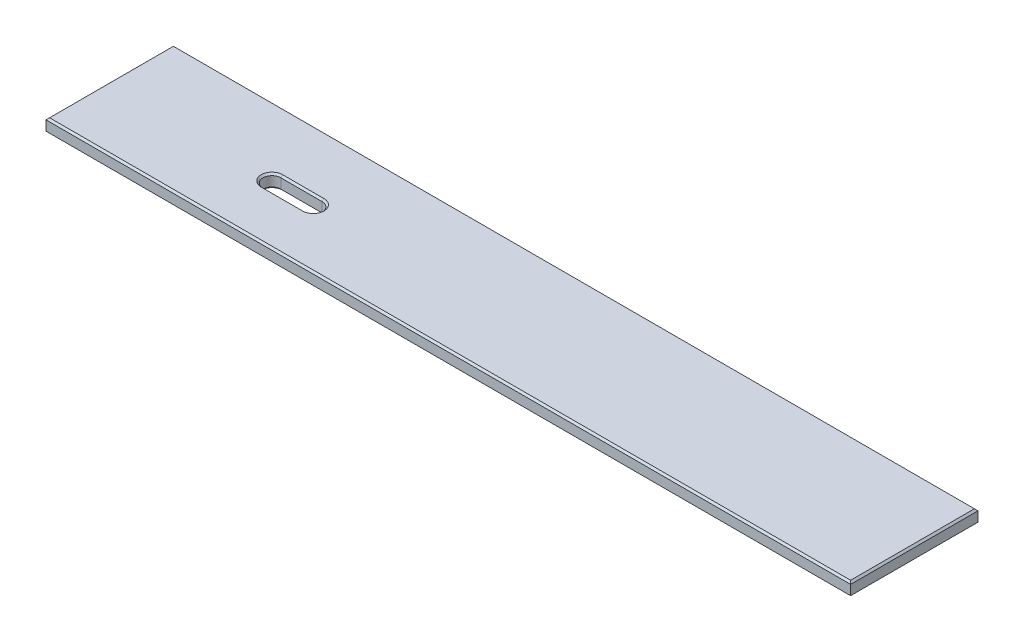
ISO-10303-21;
HEADER;
FILE_DESCRIPTION(('STEP AP214'),'2;1');
FILE_NAME('part.step','',(''),(''),'','','');
FILE_SCHEMA(('AUTOMOTIVE_DESIGN { 1 0 10303 214 1 1 1 1 }'));
ENDSEC;
DATA;
#1=APPLICATION_CONTEXT('core data for automotive mechanical design processes');
#2=APPLICATION_PROTOCOL_DEFINITION('international standard','automotive_design',2000,#1);
#3=PRODUCT_CONTEXT('',#1,'mechanical');
#4=PRODUCT('Part','Part','',(#3));
#5=PRODUCT_RELATED_PRODUCT_CATEGORY('part','',(#4));
#6=PRODUCT_DEFINITION_FORMATION('','',#4);
#7=PRODUCT_DEFINITION_CONTEXT('part definition',#1,'design');
#8=PRODUCT_DEFINITION('design','',#6,#7);
#9=PRODUCT_DEFINITION_SHAPE('','',#8);
#10=(LENGTH_UNIT() NAMED_UNIT(*) SI_UNIT(.MILLI.,.METRE.));
#11=(NAMED_UNIT(*) PLANE_ANGLE_UNIT() SI_UNIT($,.RADIAN.));
#12=(NAMED_UNIT(*) SI_UNIT($,.STERADIAN.) SOLID_ANGLE_UNIT());
#13=UNCERTAINTY_MEASURE_WITH_UNIT(LENGTH_MEASURE(1.E-05),#10,'distance_accuracy_value','');
#14=(GEOMETRIC_REPRESENTATION_CONTEXT(3) GLOBAL_UNCERTAINTY_ASSIGNED_CONTEXT((#13)) GLOBAL_UNIT_ASSIGNED_CONTEXT((#10,
#11,#12)) REPRESENTATION_CONTEXT('',''));
#15=CARTESIAN_POINT('',(0.,0.,0.));
#16=DIRECTION('',(0.,0.,1.));
#17=DIRECTION('',(1.,0.,0.));
#18=AXIS2_PLACEMENT_3D('',#15,#16,#17);
#19=CARTESIAN_POINT('',(0.,19.05,0.));
#20=DIRECTION('',(0.,-1.,0.));
#21=DIRECTION('',(0.,0.,-1.));
#22=AXIS2_PLACEMENT_3D('',#19,#20,#21);
#23=PLANE('',#22);
#24=CARTESIAN_POINT('',(238.125,19.05,-82.7913));
#25=DIRECTION('',(0.,-1.,0.));
#26=DIRECTION('',(0.,0.,-1.));
#27=AXIS2_PLACEMENT_3D('',#24,#25,#26);
#28=CIRCLE('',#27,15.2400000000006);
#29=CARTESIAN_POINT('',(238.125,19.05,-67.5512999999994));
#30=VERTEX_POINT('',#29);
#31=CARTESIAN_POINT('',(238.125,19.05,-98.0313000000006));
#32=VERTEX_POINT('',#31);
#33=EDGE_CURVE('E217',#30,#32,#28,.T.);
#34=ORIENTED_EDGE('',*,*,#33,.T.);
#35=DIRECTION('',(1.,0.,0.));
#36=VECTOR('',#35,1.);
#37=CARTESIAN_POINT('',(296.8752,19.05,-98.0313000000006));
#38=LINE('',#37,#36);
#39=CARTESIAN_POINT('',(296.8752,19.05,-98.0313000000006));
#40=VERTEX_POINT('',#39);
#41=EDGE_CURVE('E219',#32,#40,#38,.T.);
#42=ORIENTED_EDGE('',*,*,#41,.T.);
#43=CARTESIAN_POINT('',(296.8752,19.05,-82.7913));
#44=DIRECTION('',(0.,-1.,0.));
#45=DIRECTION('',(0.,0.,-1.));
#46=AXIS2_PLACEMENT_3D('',#43,#44,#45);
#47=CIRCLE('',#46,15.2400000000006);
#48=CARTESIAN_POINT('',(296.8752,19.05,-67.5512999999994));
#49=VERTEX_POINT('',#48);
#50=EDGE_CURVE('E188',#40,#49,#47,.T.);
#51=ORIENTED_EDGE('',*,*,#50,.T.);
#52=DIRECTION('',(-1.,0.,0.));
#53=VECTOR('',#52,1.);
#54=CARTESIAN_POINT('',(238.125,19.05,-67.5512999999994));
#55=LINE('',#54,#53);
#56=EDGE_CURVE('E215',#49,#30,#55,.T.);
#57=ORIENTED_EDGE('',*,*,#56,.T.);
#58=EDGE_LOOP('',(#34,#42,#51,#57));
#59=FACE_BOUND('',#58,.T.);
#60=DIRECTION('',(0.,0.,-1.));
#61=VECTOR('',#60,1.);
#62=CARTESIAN_POINT('',(1140.46,19.05,0.));
#63=LINE('',#62,#61);
#64=CARTESIAN_POINT('',(1140.46,19.05,-2.5400000000001));
#65=VERTEX_POINT('',#64);
#66=CARTESIAN_POINT('',(1140.46,19.05,-178.435));
#67=VERTEX_POINT('',#66);
#68=EDGE_CURVE('E209',#65,#67,#63,.T.);
#69=ORIENTED_EDGE('',*,*,#68,.T.);
#70=DIRECTION('',(-1.,0.,0.));
#71=VECTOR('',#70,1.);
#72=CARTESIAN_POINT('',(0.,19.05,-178.435));
#73=LINE('',#72,#71);
#74=CARTESIAN_POINT('',(2.5400000000001,19.05,-178.435));
#75=VERTEX_POINT('',#74);
#76=EDGE_CURVE('E211',#67,#75,#73,.T.);
#77=ORIENTED_EDGE('',*,*,#76,.T.);
#78=DIRECTION('',(0.,0.,1.));
#79=VECTOR('',#78,1.);
#80=CARTESIAN_POINT('',(2.5400000000001,19.05,0.));
#81=LINE('',#80,#79);
#82=CARTESIAN_POINT('',(2.5400000000001,19.05,-2.5400000000001));
#83=VERTEX_POINT('',#82);
#84=EDGE_CURVE('E198',#75,#83,#81,.T.);
#85=ORIENTED_EDGE('',*,*,#84,.T.);
#86=DIRECTION('',(1.,0.,0.));
#87=VECTOR('',#86,1.);
#88=CARTESIAN_POINT('',(0.,19.05,-2.5400000000001));
#89=LINE('',#88,#87);
#90=EDGE_CURVE('E201',#83,#65,#89,.T.);
#91=ORIENTED_EDGE('',*,*,#90,.T.);
#92=EDGE_LOOP('',(#69,#77,#85,#91));
#93=FACE_BOUND('',#92,.T.);
#94=ADVANCED_FACE('F41',(#59,#93),#23,.F.);
#95=CARTESIAN_POINT('',(0.,0.,0.));
#96=DIRECTION('',(0.,-1.,0.));
#97=DIRECTION('',(0.,0.,-1.));
#98=AXIS2_PLACEMENT_3D('',#95,#96,#97);
#99=PLANE('',#98);
#100=DIRECTION('',(-1.,0.,0.));
#101=VECTOR('',#100,1.);
#102=CARTESIAN_POINT('',(0.,0.,-98.0313));
#103=LINE('',#102,#101);
#104=CARTESIAN_POINT('',(296.8752,0.,-98.0313000000001));
#105=VERTEX_POINT('',#104);
#106=CARTESIAN_POINT('',(238.125,0.,-98.0313000000001));
#107=VERTEX_POINT('',#106);
#108=EDGE_CURVE('E261',#105,#107,#103,.T.);
#109=ORIENTED_EDGE('',*,*,#108,.T.);
#110=CARTESIAN_POINT('',(238.125,0.,-82.7913));
#111=DIRECTION('',(0.,-1.,0.));
#112=DIRECTION('',(0.,0.,-1.));
#113=AXIS2_PLACEMENT_3D('',#110,#111,#112);
#114=CIRCLE('',#113,15.2400000000001);
#115=CARTESIAN_POINT('',(238.125,0.,-67.5512999999999));
#116=VERTEX_POINT('',#115);
#117=EDGE_CURVE('E263',#107,#116,#114,.F.);
#118=ORIENTED_EDGE('',*,*,#117,.T.);
#119=DIRECTION('',(1.,0.,0.));
#120=VECTOR('',#119,1.);
#121=CARTESIAN_POINT('',(0.,0.,-67.5512999999998));
#122=LINE('',#121,#120);
#123=CARTESIAN_POINT('',(296.8752,0.,-67.5512999999999));
#124=VERTEX_POINT('',#123);
#125=EDGE_CURVE('E257',#116,#124,#122,.T.);
#126=ORIENTED_EDGE('',*,*,#125,.T.);
#127=CARTESIAN_POINT('',(296.8752,0.,-82.7913));
#128=DIRECTION('',(0.,-1.,0.));
#129=DIRECTION('',(0.,0.,-1.));
#130=AXIS2_PLACEMENT_3D('',#127,#128,#129);
#131=CIRCLE('',#130,15.2400000000001);
#132=EDGE_CURVE('E259',#124,#105,#131,.F.);
#133=ORIENTED_EDGE('',*,*,#132,.T.);
#134=EDGE_LOOP('',(#109,#118,#126,#133));
#135=FACE_BOUND('',#134,.T.);
#136=DIRECTION('',(0.,0.,1.));
#137=VECTOR('',#136,1.);
#138=CARTESIAN_POINT('',(1140.46,0.,0.));
#139=LINE('',#138,#137);
#140=CARTESIAN_POINT('',(1140.46,0.,-178.435));
#141=VERTEX_POINT('',#140);
#142=CARTESIAN_POINT('',(1140.46,0.,-2.53999999999999));
#143=VERTEX_POINT('',#142);
#144=EDGE_CURVE('E252',#141,#143,#139,.T.);
#145=ORIENTED_EDGE('',*,*,#144,.T.);
#146=DIRECTION('',(-1.,0.,0.));
#147=VECTOR('',#146,1.);
#148=CARTESIAN_POINT('',(0.,0.,-2.53999999999999));
#149=LINE('',#148,#147);
#150=CARTESIAN_POINT('',(2.53999999999999,0.,-2.53999999999999));
#151=VERTEX_POINT('',#150);
#152=EDGE_CURVE('E254',#143,#151,#149,.T.);
#153=ORIENTED_EDGE('',*,*,#152,.T.);
#154=DIRECTION('',(0.,0.,-1.));
#155=VECTOR('',#154,1.);
#156=CARTESIAN_POINT('',(2.53999999999999,0.,-180.975));
#157=LINE('',#156,#155);
#158=CARTESIAN_POINT('',(2.53999999999999,0.,-178.435));
#159=VERTEX_POINT('',#158);
#160=EDGE_CURVE('E232',#151,#159,#157,.T.);
#161=ORIENTED_EDGE('',*,*,#160,.T.);
#162=DIRECTION('',(1.,0.,0.));
#163=VECTOR('',#162,1.);
#164=CARTESIAN_POINT('',(1143.,0.,-178.435));
#165=LINE('',#164,#163);
#166=EDGE_CURVE('E250',#159,#141,#165,.T.);
#167=ORIENTED_EDGE('',*,*,#166,.T.);
#168=EDGE_LOOP('',(#145,#153,#161,#167));
#169=FACE_BOUND('',#168,.T.);
#170=ADVANCED_FACE('F306',(#135,#169),#99,.T.);
#171=CARTESIAN_POINT('',(0.,19.05,0.));
#172=DIRECTION('',(1.,0.,0.));
#173=DIRECTION('',(0.,0.,-1.));
#174=AXIS2_PLACEMENT_3D('',#171,#172,#173);
#175=PLANE('',#174);
#176=DIRECTION('',(0.,-1.,0.));
#177=VECTOR('',#176,1.);
#178=CARTESIAN_POINT('',(0.,19.05,-180.975));
#179=LINE('',#178,#177);
#180=CARTESIAN_POINT('',(0.,16.51,-180.975));
#181=VERTEX_POINT('',#180);
#182=CARTESIAN_POINT('',(0.,2.5400000000001,-180.975));
#183=VERTEX_POINT('',#182);
#184=EDGE_CURVE('E182',#181,#183,#179,.T.);
#185=ORIENTED_EDGE('',*,*,#184,.T.);
#186=DIRECTION('',(0.,0.,1.));
#187=VECTOR('',#186,1.);
#188=CARTESIAN_POINT('',(0.,2.5400000000001,0.));
#189=LINE('',#188,#187);
#190=CARTESIAN_POINT('',(0.,2.5400000000001,0.));
#191=VERTEX_POINT('',#190);
#192=EDGE_CURVE('E11',#183,#191,#189,.T.);
#193=ORIENTED_EDGE('',*,*,#192,.T.);
#194=DIRECTION('',(0.,-1.,0.));
#195=VECTOR('',#194,1.);
#196=CARTESIAN_POINT('',(0.,19.05,0.));
#197=LINE('',#196,#195);
#198=CARTESIAN_POINT('',(0.,16.51,0.));
#199=VERTEX_POINT('',#198);
#200=EDGE_CURVE('E199',#199,#191,#197,.T.);
#201=ORIENTED_EDGE('',*,*,#200,.F.);
#202=DIRECTION('',(0.,0.,-1.));
#203=VECTOR('',#202,1.);
#204=CARTESIAN_POINT('',(0.,16.51,0.));
#205=LINE('',#204,#203);
#206=EDGE_CURVE('E230',#199,#181,#205,.T.);
#207=ORIENTED_EDGE('',*,*,#206,.T.);
#208=EDGE_LOOP('',(#185,#193,#201,#207));
#209=FACE_BOUND('',#208,.T.);
#210=ADVANCED_FACE('F379',(#209),#175,.F.);
#211=CARTESIAN_POINT('',(0.,19.05,0.));
#212=DIRECTION('',(0.,0.,-1.));
#213=DIRECTION('',(-1.,0.,0.));
#214=AXIS2_PLACEMENT_3D('',#211,#212,#213);
#215=PLANE('',#214);
#216=ORIENTED_EDGE('',*,*,#200,.T.);
#217=DIRECTION('',(1.,0.,0.));
#218=VECTOR('',#217,1.);
#219=CARTESIAN_POINT('',(1143.,2.5400000000001,0.));
#220=LINE('',#219,#218);
#221=CARTESIAN_POINT('',(1143.,2.5400000000001,0.));
#222=VERTEX_POINT('',#221);
#223=EDGE_CURVE('E274',#191,#222,#220,.T.);
#224=ORIENTED_EDGE('',*,*,#223,.T.);
#225=DIRECTION('',(0.,-1.,0.));
#226=VECTOR('',#225,1.);
#227=CARTESIAN_POINT('',(1143.,19.05,0.));
#228=LINE('',#227,#226);
#229=CARTESIAN_POINT('',(1143.,16.51,0.));
#230=VERTEX_POINT('',#229);
#231=EDGE_CURVE('E204',#230,#222,#228,.T.);
#232=ORIENTED_EDGE('',*,*,#231,.F.);
#233=DIRECTION('',(-1.,0.,0.));
#234=VECTOR('',#233,1.);
#235=CARTESIAN_POINT('',(0.,16.51,0.));
#236=LINE('',#235,#234);
#237=EDGE_CURVE('E228',#230,#199,#236,.T.);
#238=ORIENTED_EDGE('',*,*,#237,.T.);
#239=EDGE_LOOP('',(#216,#224,#232,#238));
#240=FACE_BOUND('',#239,.T.);
#241=ADVANCED_FACE('F315',(#240),#215,.F.);
#242=CARTESIAN_POINT('',(1143.,19.05,0.));
#243=DIRECTION('',(-1.,0.,0.));
#244=DIRECTION('',(0.,0.,1.));
#245=AXIS2_PLACEMENT_3D('',#242,#243,#244);
#246=PLANE('',#245);
#247=ORIENTED_EDGE('',*,*,#231,.T.);
#248=DIRECTION('',(0.,0.,-1.));
#249=VECTOR('',#248,1.);
#250=CARTESIAN_POINT('',(1143.,2.5400000000001,-180.975));
#251=LINE('',#250,#249);
#252=CARTESIAN_POINT('',(1143.,2.5400000000001,-180.975));
#253=VERTEX_POINT('',#252);
#254=EDGE_CURVE('E66',#222,#253,#251,.T.);
#255=ORIENTED_EDGE('',*,*,#254,.T.);
#256=DIRECTION('',(0.,-1.,0.));
#257=VECTOR('',#256,1.);
#258=CARTESIAN_POINT('',(1143.,19.05,-180.975));
#259=LINE('',#258,#257);
#260=CARTESIAN_POINT('',(1143.,16.51,-180.975));
#261=VERTEX_POINT('',#260);
#262=EDGE_CURVE('E320',#261,#253,#259,.T.);
#263=ORIENTED_EDGE('',*,*,#262,.F.);
#264=DIRECTION('',(0.,0.,1.));
#265=VECTOR('',#264,1.);
#266=CARTESIAN_POINT('',(1143.,16.51,0.));
#267=LINE('',#266,#265);
#268=EDGE_CURVE('E226',#261,#230,#267,.T.);
#269=ORIENTED_EDGE('',*,*,#268,.T.);
#270=EDGE_LOOP('',(#247,#255,#263,#269));
#271=FACE_BOUND('',#270,.T.);
#272=ADVANCED_FACE('F318',(#271),#246,.F.);
#273=CARTESIAN_POINT('',(0.,19.05,-180.975));
#274=DIRECTION('',(0.,0.,1.));
#275=DIRECTION('',(1.,0.,0.));
#276=AXIS2_PLACEMENT_3D('',#273,#274,#275);
#277=PLANE('',#276);
#278=ORIENTED_EDGE('',*,*,#262,.T.);
#279=DIRECTION('',(-1.,0.,0.));
#280=VECTOR('',#279,1.);
#281=CARTESIAN_POINT('',(0.,2.5400000000001,-180.975));
#282=LINE('',#281,#280);
#283=EDGE_CURVE('E51',#253,#183,#282,.T.);
#284=ORIENTED_EDGE('',*,*,#283,.T.);
#285=ORIENTED_EDGE('',*,*,#184,.F.);
#286=DIRECTION('',(1.,0.,0.));
#287=VECTOR('',#286,1.);
#288=CARTESIAN_POINT('',(0.,16.51,-180.975));
#289=LINE('',#288,#287);
#290=EDGE_CURVE('E170',#181,#261,#289,.T.);
#291=ORIENTED_EDGE('',*,*,#290,.T.);
#292=EDGE_LOOP('',(#278,#284,#285,#291));
#293=FACE_BOUND('',#292,.T.);
#294=ADVANCED_FACE('F380',(#293),#277,.F.);
#295=CARTESIAN_POINT('',(296.8752,19.05,-82.7913));
#296=DIRECTION('',(0.,-1.,0.));
#297=DIRECTION('',(0.,0.,-1.));
#298=AXIS2_PLACEMENT_3D('',#295,#296,#297);
#299=CYLINDRICAL_SURFACE('',#298,12.7);
#300=DIRECTION('',(0.,-1.,0.));
#301=VECTOR('',#300,1.);
#302=CARTESIAN_POINT('',(296.8752,19.05,-95.4913));
#303=LINE('',#302,#301);
#304=CARTESIAN_POINT('',(296.8752,16.5099999999995,-95.4913));
#305=VERTEX_POINT('',#304);
#306=CARTESIAN_POINT('',(296.8752,2.5400000000001,-95.4913));
#307=VERTEX_POINT('',#306);
#308=EDGE_CURVE('E162',#305,#307,#303,.T.);
#309=ORIENTED_EDGE('',*,*,#308,.T.);
#310=CARTESIAN_POINT('',(296.8752,2.5400000000001,-82.7913));
#311=DIRECTION('',(0.,-1.,0.));
#312=DIRECTION('',(0.,0.,-1.));
#313=AXIS2_PLACEMENT_3D('',#310,#311,#312);
#314=CIRCLE('',#313,12.7);
#315=CARTESIAN_POINT('',(296.8752,2.5400000000001,-70.0913));
#316=VERTEX_POINT('',#315);
#317=EDGE_CURVE('E270',#307,#316,#314,.T.);
#318=ORIENTED_EDGE('',*,*,#317,.T.);
#319=DIRECTION('',(0.,-1.,0.));
#320=VECTOR('',#319,1.);
#321=CARTESIAN_POINT('',(296.8752,19.05,-70.0913));
#322=LINE('',#321,#320);
#323=CARTESIAN_POINT('',(296.8752,16.5099999999995,-70.0913));
#324=VERTEX_POINT('',#323);
#325=EDGE_CURVE('E165',#324,#316,#322,.T.);
#326=ORIENTED_EDGE('',*,*,#325,.F.);
#327=CARTESIAN_POINT('',(296.8752,16.5099999999995,-82.7913));
#328=DIRECTION('',(0.,-1.,0.));
#329=DIRECTION('',(0.,0.,-1.));
#330=AXIS2_PLACEMENT_3D('',#327,#328,#329);
#331=CIRCLE('',#330,12.7);
#332=EDGE_CURVE('E159',#324,#305,#331,.F.);
#333=ORIENTED_EDGE('',*,*,#332,.T.);
#334=EDGE_LOOP('',(#309,#318,#326,#333));
#335=FACE_BOUND('',#334,.T.);
#336=ADVANCED_FACE('F161',(#335),#299,.F.);
#337=CARTESIAN_POINT('',(238.125,19.05,-95.4913));
#338=DIRECTION('',(0.,0.,1.));
#339=DIRECTION('',(1.,0.,0.));
#340=AXIS2_PLACEMENT_3D('',#337,#338,#339);
#341=PLANE('',#340);
#342=DIRECTION('',(0.,-1.,0.));
#343=VECTOR('',#342,1.);
#344=CARTESIAN_POINT('',(238.125,19.05,-95.4913));
#345=LINE('',#344,#343);
#346=CARTESIAN_POINT('',(238.125,16.5099999999995,-95.4913));
#347=VERTEX_POINT('',#346);
#348=CARTESIAN_POINT('',(238.125,2.5400000000001,-95.4913));
#349=VERTEX_POINT('',#348);
#350=EDGE_CURVE('E183',#347,#349,#345,.T.);
#351=ORIENTED_EDGE('',*,*,#350,.T.);
#352=DIRECTION('',(1.,0.,0.));
#353=VECTOR('',#352,1.);
#354=CARTESIAN_POINT('',(238.125,2.5400000000001,-95.4913));
#355=LINE('',#354,#353);
#356=EDGE_CURVE('E181',#349,#307,#355,.T.);
#357=ORIENTED_EDGE('',*,*,#356,.T.);
#358=ORIENTED_EDGE('',*,*,#308,.F.);
#359=DIRECTION('',(-1.,0.,0.));
#360=VECTOR('',#359,1.);
#361=CARTESIAN_POINT('',(238.125,16.5099999999995,-95.4913));
#362=LINE('',#361,#360);
#363=EDGE_CURVE('E178',#305,#347,#362,.T.);
#364=ORIENTED_EDGE('',*,*,#363,.T.);
#365=EDGE_LOOP('',(#351,#357,#358,#364));
#366=FACE_BOUND('',#365,.T.);
#367=ADVANCED_FACE('F176',(#366),#341,.T.);
#368=CARTESIAN_POINT('',(238.125,19.05,-82.7913));
#369=DIRECTION('',(0.,-1.,0.));
#370=DIRECTION('',(0.,0.,-1.));
#371=AXIS2_PLACEMENT_3D('',#368,#369,#370);
#372=CYLINDRICAL_SURFACE('',#371,12.7);
#373=DIRECTION('',(0.,-1.,0.));
#374=VECTOR('',#373,1.);
#375=CARTESIAN_POINT('',(238.125,19.05,-70.0913));
#376=LINE('',#375,#374);
#377=CARTESIAN_POINT('',(238.125,16.5099999999995,-70.0913));
#378=VERTEX_POINT('',#377);
#379=CARTESIAN_POINT('',(238.125,2.5400000000001,-70.0913));
#380=VERTEX_POINT('',#379);
#381=EDGE_CURVE('E325',#378,#380,#376,.T.);
#382=ORIENTED_EDGE('',*,*,#381,.T.);
#383=CARTESIAN_POINT('',(238.125,2.5400000000001,-82.7913));
#384=DIRECTION('',(0.,-1.,0.));
#385=DIRECTION('',(0.,0.,-1.));
#386=AXIS2_PLACEMENT_3D('',#383,#384,#385);
#387=CIRCLE('',#386,12.7);
#388=EDGE_CURVE('E266',#380,#349,#387,.T.);
#389=ORIENTED_EDGE('',*,*,#388,.T.);
#390=ORIENTED_EDGE('',*,*,#350,.F.);
#391=CARTESIAN_POINT('',(238.125,16.5099999999995,-82.7913));
#392=DIRECTION('',(0.,-1.,0.));
#393=DIRECTION('',(0.,0.,-1.));
#394=AXIS2_PLACEMENT_3D('',#391,#392,#393);
#395=CIRCLE('',#394,12.7);
#396=EDGE_CURVE('E221',#347,#378,#395,.F.);
#397=ORIENTED_EDGE('',*,*,#396,.T.);
#398=EDGE_LOOP('',(#382,#389,#390,#397));
#399=FACE_BOUND('',#398,.T.);
#400=ADVANCED_FACE('F348',(#399),#372,.F.);
#401=CARTESIAN_POINT('',(238.125,19.05,-70.0913));
#402=DIRECTION('',(0.,0.,-1.));
#403=DIRECTION('',(-1.,0.,0.));
#404=AXIS2_PLACEMENT_3D('',#401,#402,#403);
#405=PLANE('',#404);
#406=ORIENTED_EDGE('',*,*,#325,.T.);
#407=DIRECTION('',(-1.,0.,0.));
#408=VECTOR('',#407,1.);
#409=CARTESIAN_POINT('',(238.125,2.5400000000001,-70.0913));
#410=LINE('',#409,#408);
#411=EDGE_CURVE('E272',#316,#380,#410,.T.);
#412=ORIENTED_EDGE('',*,*,#411,.T.);
#413=ORIENTED_EDGE('',*,*,#381,.F.);
#414=DIRECTION('',(1.,0.,0.));
#415=VECTOR('',#414,1.);
#416=CARTESIAN_POINT('',(296.8752,16.5099999999995,-70.0913));
#417=LINE('',#416,#415);
#418=EDGE_CURVE('E171',#378,#324,#417,.T.);
#419=ORIENTED_EDGE('',*,*,#418,.T.);
#420=EDGE_LOOP('',(#406,#412,#413,#419));
#421=FACE_BOUND('',#420,.T.);
#422=ADVANCED_FACE('F330',(#421),#405,.T.);
#423=CARTESIAN_POINT('',(238.125,16.5099999999995,-70.0913));
#424=DIRECTION('',(0.,0.707106781186556,-0.707106781186538));
#425=DIRECTION('',(-1.,0.,0.));
#426=AXIS2_PLACEMENT_3D('',#423,#424,#425);
#427=PLANE('',#426);
#428=DIRECTION('',(0.,-0.707106781186538,-0.707106781186557));
#429=VECTOR('',#428,1.);
#430=CARTESIAN_POINT('',(238.125,19.05,-67.5512999999994));
#431=LINE('',#430,#429);
#432=EDGE_CURVE('E192',#30,#378,#431,.T.);
#433=ORIENTED_EDGE('',*,*,#432,.F.);
#434=ORIENTED_EDGE('',*,*,#56,.F.);
#435=DIRECTION('',(0.,0.707106781186538,0.707106781186557));
#436=VECTOR('',#435,1.);
#437=CARTESIAN_POINT('',(296.8752,16.5099999999995,-70.0913));
#438=LINE('',#437,#436);
#439=EDGE_CURVE('E237',#324,#49,#438,.T.);
#440=ORIENTED_EDGE('',*,*,#439,.F.);
#441=ORIENTED_EDGE('',*,*,#418,.F.);
#442=EDGE_LOOP('',(#433,#434,#440,#441));
#443=FACE_BOUND('',#442,.T.);
#444=ADVANCED_FACE('F351',(#443),#427,.T.);
#445=CARTESIAN_POINT('',(296.8752,16.5099999999995,-82.7913));
#446=DIRECTION('',(0.,1.,0.));
#447=DIRECTION('',(0.,0.,1.));
#448=AXIS2_PLACEMENT_3D('',#445,#446,#447);
#449=CONICAL_SURFACE('',#448,12.7,0.785398163397461);
#450=ORIENTED_EDGE('',*,*,#439,.T.);
#451=ORIENTED_EDGE('',*,*,#50,.F.);
#452=DIRECTION('',(0.,0.707106781186538,-0.707106781186557));
#453=VECTOR('',#452,1.);
#454=CARTESIAN_POINT('',(296.8752,16.5099999999995,-95.4913));
#455=LINE('',#454,#453);
#456=EDGE_CURVE('E186',#305,#40,#455,.T.);
#457=ORIENTED_EDGE('',*,*,#456,.F.);
#458=ORIENTED_EDGE('',*,*,#332,.F.);
#459=EDGE_LOOP('',(#450,#451,#457,#458));
#460=FACE_BOUND('',#459,.T.);
#461=ADVANCED_FACE('F187',(#460),#449,.F.);
#462=CARTESIAN_POINT('',(238.125,16.5099999999995,-82.7913));
#463=DIRECTION('',(0.,1.,0.));
#464=DIRECTION('',(0.,0.,1.));
#465=AXIS2_PLACEMENT_3D('',#462,#463,#464);
#466=CONICAL_SURFACE('',#465,12.7,0.785398163397461);
#467=ORIENTED_EDGE('',*,*,#432,.T.);
#468=ORIENTED_EDGE('',*,*,#396,.F.);
#469=DIRECTION('',(0.,-0.707106781186538,0.707106781186557));
#470=VECTOR('',#469,1.);
#471=CARTESIAN_POINT('',(238.125,19.05,-98.0313000000006));
#472=LINE('',#471,#470);
#473=EDGE_CURVE('E193',#32,#347,#472,.T.);
#474=ORIENTED_EDGE('',*,*,#473,.F.);
#475=ORIENTED_EDGE('',*,*,#33,.F.);
#476=EDGE_LOOP('',(#467,#468,#474,#475));
#477=FACE_BOUND('',#476,.T.);
#478=ADVANCED_FACE('F355',(#477),#466,.F.);
#479=CARTESIAN_POINT('',(238.125,16.5099999999995,-95.4913));
#480=DIRECTION('',(0.,0.707106781186557,0.707106781186538));
#481=DIRECTION('',(1.,0.,0.));
#482=AXIS2_PLACEMENT_3D('',#479,#480,#481);
#483=PLANE('',#482);
#484=ORIENTED_EDGE('',*,*,#456,.T.);
#485=ORIENTED_EDGE('',*,*,#41,.F.);
#486=ORIENTED_EDGE('',*,*,#473,.T.);
#487=ORIENTED_EDGE('',*,*,#363,.F.);
#488=EDGE_LOOP('',(#484,#485,#486,#487));
#489=FACE_BOUND('',#488,.T.);
#490=ADVANCED_FACE('F195',(#489),#483,.T.);
#491=CARTESIAN_POINT('',(0.,19.05,-2.5400000000001));
#492=DIRECTION('',(0.,-0.707106781186563,-0.707106781186532));
#493=DIRECTION('',(1.,0.,0.));
#494=AXIS2_PLACEMENT_3D('',#491,#492,#493);
#495=PLANE('',#494);
#496=DIRECTION('',(0.577350269189634,0.577350269189609,-0.577350269189634));
#497=VECTOR('',#496,1.);
#498=CARTESIAN_POINT('',(1.69333333333337,18.2033333333333,-1.69333333333337));
#499=LINE('',#498,#497);
#500=EDGE_CURVE('E244',#199,#83,#499,.T.);
#501=ORIENTED_EDGE('',*,*,#500,.F.);
#502=ORIENTED_EDGE('',*,*,#237,.F.);
#503=DIRECTION('',(-0.577350269189617,0.577350269189618,-0.577350269189642));
#504=VECTOR('',#503,1.);
#505=CARTESIAN_POINT('',(760.306666666678,399.203333333322,-382.693333333339));
#506=LINE('',#505,#504);
#507=EDGE_CURVE('E233',#65,#230,#506,.F.);
#508=ORIENTED_EDGE('',*,*,#507,.F.);
#509=ORIENTED_EDGE('',*,*,#90,.F.);
#510=EDGE_LOOP('',(#501,#502,#508,#509));
#511=FACE_BOUND('',#510,.T.);
#512=ADVANCED_FACE('F377',(#511),#495,.F.);
#513=CARTESIAN_POINT('',(1140.46,19.05,0.));
#514=DIRECTION('',(-0.707106781186548,-0.707106781186548,0.));
#515=DIRECTION('',(0.,0.,-1.));
#516=AXIS2_PLACEMENT_3D('',#513,#514,#515);
#517=PLANE('',#516);
#518=ORIENTED_EDGE('',*,*,#507,.T.);
#519=ORIENTED_EDGE('',*,*,#268,.F.);
#520=DIRECTION('',(-0.577350269189617,0.577350269189617,0.577350269189642));
#521=VECTOR('',#520,1.);
#522=CARTESIAN_POINT('',(1080.98166666667,78.5283333333342,-118.956666666663));
#523=LINE('',#522,#521);
#524=EDGE_CURVE('E241',#67,#261,#523,.F.);
#525=ORIENTED_EDGE('',*,*,#524,.F.);
#526=ORIENTED_EDGE('',*,*,#68,.F.);
#527=EDGE_LOOP('',(#518,#519,#525,#526));
#528=FACE_BOUND('',#527,.T.);
#529=ADVANCED_FACE('F366',(#528),#517,.F.);
#530=CARTESIAN_POINT('',(2.5400000000001,19.05,0.));
#531=DIRECTION('',(0.707106781186532,-0.707106781186563,0.));
#532=DIRECTION('',(0.,0.,1.));
#533=AXIS2_PLACEMENT_3D('',#530,#531,#532);
#534=PLANE('',#533);
#535=ORIENTED_EDGE('',*,*,#500,.T.);
#536=ORIENTED_EDGE('',*,*,#84,.F.);
#537=DIRECTION('',(-0.577350269189634,-0.577350269189609,-0.577350269189634));
#538=VECTOR('',#537,1.);
#539=CARTESIAN_POINT('',(62.0183333333351,78.5283333333325,-118.956666666665));
#540=LINE('',#539,#538);
#541=EDGE_CURVE('E239',#181,#75,#540,.F.);
#542=ORIENTED_EDGE('',*,*,#541,.F.);
#543=ORIENTED_EDGE('',*,*,#206,.F.);
#544=EDGE_LOOP('',(#535,#536,#542,#543));
#545=FACE_BOUND('',#544,.T.);
#546=ADVANCED_FACE('F374',(#545),#534,.F.);
#547=CARTESIAN_POINT('',(0.,19.05,-178.435));
#548=DIRECTION('',(0.,-0.707106781186563,0.707106781186532));
#549=DIRECTION('',(-1.,0.,0.));
#550=AXIS2_PLACEMENT_3D('',#547,#548,#549);
#551=PLANE('',#550);
#552=ORIENTED_EDGE('',*,*,#524,.T.);
#553=ORIENTED_EDGE('',*,*,#290,.F.);
#554=ORIENTED_EDGE('',*,*,#541,.T.);
#555=ORIENTED_EDGE('',*,*,#76,.F.);
#556=EDGE_LOOP('',(#552,#553,#554,#555));
#557=FACE_BOUND('',#556,.T.);
#558=ADVANCED_FACE('F369',(#557),#551,.F.);
#559=CARTESIAN_POINT('',(296.8752,0.,-82.7913));
#560=DIRECTION('',(0.,-1.,0.));
#561=DIRECTION('',(0.,0.,-1.));
#562=AXIS2_PLACEMENT_3D('',#559,#560,#561);
#563=CONICAL_SURFACE('',#562,15.2400000000001,0.785398163397448);
#564=DIRECTION('',(0.,-0.707106781186548,0.707106781186548));
#565=VECTOR('',#564,1.);
#566=CARTESIAN_POINT('',(296.8752,2.5400000000001,-70.0913));
#567=LINE('',#566,#565);
#568=EDGE_CURVE('E283',#316,#124,#567,.T.);
#569=ORIENTED_EDGE('',*,*,#568,.F.);
#570=ORIENTED_EDGE('',*,*,#317,.F.);
#571=DIRECTION('',(0.,0.707106781186548,0.707106781186548));
#572=VECTOR('',#571,1.);
#573=CARTESIAN_POINT('',(296.8752,0.,-98.0313000000001));
#574=LINE('',#573,#572);
#575=EDGE_CURVE('E242',#105,#307,#574,.T.);
#576=ORIENTED_EDGE('',*,*,#575,.F.);
#577=ORIENTED_EDGE('',*,*,#132,.F.);
#578=EDGE_LOOP('',(#569,#570,#576,#577));
#579=FACE_BOUND('',#578,.T.);
#580=ADVANCED_FACE('F336',(#579),#563,.F.);
#581=CARTESIAN_POINT('',(0.,0.,-98.0313));
#582=DIRECTION('',(0.,0.707106781186548,-0.707106781186547));
#583=DIRECTION('',(-1.,0.,0.));
#584=AXIS2_PLACEMENT_3D('',#581,#582,#583);
#585=PLANE('',#584);
#586=ORIENTED_EDGE('',*,*,#575,.T.);
#587=ORIENTED_EDGE('',*,*,#356,.F.);
#588=DIRECTION('',(0.,0.707106781186548,0.707106781186548));
#589=VECTOR('',#588,1.);
#590=CARTESIAN_POINT('',(238.125,0.,-98.0313000000001));
#591=LINE('',#590,#589);
#592=EDGE_CURVE('E281',#107,#349,#591,.T.);
#593=ORIENTED_EDGE('',*,*,#592,.F.);
#594=ORIENTED_EDGE('',*,*,#108,.F.);
#595=EDGE_LOOP('',(#586,#587,#593,#594));
#596=FACE_BOUND('',#595,.T.);
#597=ADVANCED_FACE('F447',(#596),#585,.F.);
#598=CARTESIAN_POINT('',(0.,0.,-67.5512999999998));
#599=DIRECTION('',(0.,0.707106781186547,0.707106781186548));
#600=DIRECTION('',(1.,0.,0.));
#601=AXIS2_PLACEMENT_3D('',#598,#599,#600);
#602=PLANE('',#601);
#603=ORIENTED_EDGE('',*,*,#568,.T.);
#604=ORIENTED_EDGE('',*,*,#125,.F.);
#605=DIRECTION('',(0.,-0.707106781186548,0.707106781186547));
#606=VECTOR('',#605,1.);
#607=CARTESIAN_POINT('',(238.125,2.5400000000001,-70.0913));
#608=LINE('',#607,#606);
#609=EDGE_CURVE('E279',#380,#116,#608,.T.);
#610=ORIENTED_EDGE('',*,*,#609,.F.);
#611=ORIENTED_EDGE('',*,*,#411,.F.);
#612=EDGE_LOOP('',(#603,#604,#610,#611));
#613=FACE_BOUND('',#612,.T.);
#614=ADVANCED_FACE('F341',(#613),#602,.F.);
#615=CARTESIAN_POINT('',(238.125,0.,-82.7913));
#616=DIRECTION('',(0.,-1.,0.));
#617=DIRECTION('',(0.,0.,-1.));
#618=AXIS2_PLACEMENT_3D('',#615,#616,#617);
#619=CONICAL_SURFACE('',#618,15.2400000000001,0.785398163397448);
#620=ORIENTED_EDGE('',*,*,#592,.T.);
#621=ORIENTED_EDGE('',*,*,#388,.F.);
#622=ORIENTED_EDGE('',*,*,#609,.T.);
#623=ORIENTED_EDGE('',*,*,#117,.F.);
#624=EDGE_LOOP('',(#620,#621,#622,#623));
#625=FACE_BOUND('',#624,.T.);
#626=ADVANCED_FACE('F345',(#625),#619,.F.);
#627=CARTESIAN_POINT('',(0.,2.5400000000001,-180.975));
#628=DIRECTION('',(0.,-0.707106781186532,-0.707106781186563));
#629=DIRECTION('',(1.,0.,0.));
#630=AXIS2_PLACEMENT_3D('',#627,#628,#629);
#631=PLANE('',#630);
#632=DIRECTION('',(-0.577350269189617,-0.577350269189642,0.577350269189617));
#633=VECTOR('',#632,1.);
#634=CARTESIAN_POINT('',(762.000000000011,-378.460000000005,200.024999999989));
#635=LINE('',#634,#633);
#636=EDGE_CURVE('E291',#141,#253,#635,.F.);
#637=ORIENTED_EDGE('',*,*,#636,.F.);
#638=ORIENTED_EDGE('',*,*,#166,.F.);
#639=DIRECTION('',(0.577350269189617,-0.577350269189643,0.577350269189617));
#640=VECTOR('',#639,1.);
#641=CARTESIAN_POINT('',(60.3249999999982,-57.7850000000008,-120.650000000002));
#642=LINE('',#641,#640);
#643=EDGE_CURVE('E46',#183,#159,#642,.T.);
#644=ORIENTED_EDGE('',*,*,#643,.F.);
#645=ORIENTED_EDGE('',*,*,#283,.F.);
#646=EDGE_LOOP('',(#637,#638,#644,#645));
#647=FACE_BOUND('',#646,.T.);
#648=ADVANCED_FACE('F44',(#647),#631,.T.);
#649=CARTESIAN_POINT('',(0.,2.5400000000001,0.));
#650=DIRECTION('',(-0.707106781186563,-0.707106781186532,0.));
#651=DIRECTION('',(0.,0.,-1.));
#652=AXIS2_PLACEMENT_3D('',#649,#650,#651);
#653=PLANE('',#652);
#654=ORIENTED_EDGE('',*,*,#643,.T.);
#655=ORIENTED_EDGE('',*,*,#160,.F.);
#656=DIRECTION('',(-0.577350269189617,0.577350269189643,0.577350269189617));
#657=VECTOR('',#656,1.);
#658=CARTESIAN_POINT('',(0.,2.5400000000001,0.));
#659=LINE('',#658,#657);
#660=EDGE_CURVE('E290',#191,#151,#659,.F.);
#661=ORIENTED_EDGE('',*,*,#660,.F.);
#662=ORIENTED_EDGE('',*,*,#192,.F.);
#663=EDGE_LOOP('',(#654,#655,#661,#662));
#664=FACE_BOUND('',#663,.T.);
#665=ADVANCED_FACE('F301',(#664),#653,.T.);
#666=CARTESIAN_POINT('',(1143.,2.5400000000001,0.));
#667=DIRECTION('',(0.707106781186563,-0.707106781186532,0.));
#668=DIRECTION('',(0.,0.,1.));
#669=AXIS2_PLACEMENT_3D('',#666,#667,#668);
#670=PLANE('',#669);
#671=ORIENTED_EDGE('',*,*,#636,.T.);
#672=ORIENTED_EDGE('',*,*,#254,.F.);
#673=DIRECTION('',(-0.577350269189617,-0.577350269189643,-0.577350269189617));
#674=VECTOR('',#673,1.);
#675=CARTESIAN_POINT('',(1143.,2.5400000000001,0.));
#676=LINE('',#675,#674);
#677=EDGE_CURVE('E288',#143,#222,#676,.F.);
#678=ORIENTED_EDGE('',*,*,#677,.F.);
#679=ORIENTED_EDGE('',*,*,#144,.F.);
#680=EDGE_LOOP('',(#671,#672,#678,#679));
#681=FACE_BOUND('',#680,.T.);
#682=ADVANCED_FACE('F312',(#681),#670,.T.);
#683=CARTESIAN_POINT('',(0.,2.5400000000001,0.));
#684=DIRECTION('',(0.,-0.707106781186532,0.707106781186563));
#685=DIRECTION('',(-1.,0.,0.));
#686=AXIS2_PLACEMENT_3D('',#683,#684,#685);
#687=PLANE('',#686);
#688=ORIENTED_EDGE('',*,*,#660,.T.);
#689=ORIENTED_EDGE('',*,*,#152,.F.);
#690=ORIENTED_EDGE('',*,*,#677,.T.);
#691=ORIENTED_EDGE('',*,*,#223,.F.);
#692=EDGE_LOOP('',(#688,#689,#690,#691));
#693=FACE_BOUND('',#692,.T.);
#694=ADVANCED_FACE('F310',(#693),#687,.T.);
#695=CLOSED_SHELL('',(#94,#170,#210,#241,#272,#294,#336,#367,#400,#422,#444,#461,#478,#490,#512,
#529,#546,#558,#580,#597,#614,#626,#648,#665,#682,#694));
#696=MANIFOLD_SOLID_BREP('B2',#695);
#697=ADVANCED_BREP_SHAPE_REPRESENTATION('',(#18,#696),#14);
#698=SHAPE_DEFINITION_REPRESENTATION(#9,#697);
ENDSEC;
END-ISO-10303-21;
